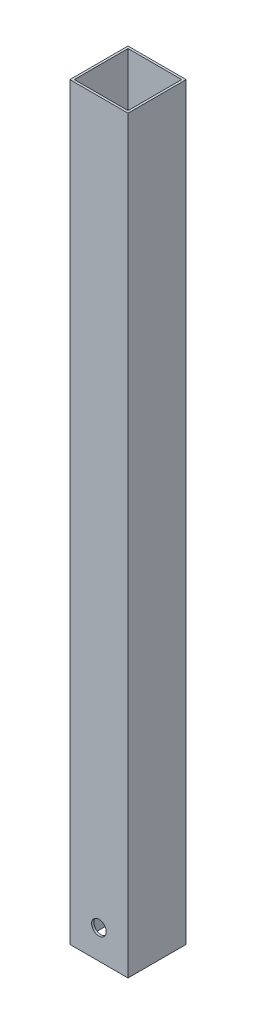
ISO-10303-21;
HEADER;
FILE_DESCRIPTION(('STEP AP214'),'2;1');
FILE_NAME('part.step','',(''),(''),'','','');
FILE_SCHEMA(('AUTOMOTIVE_DESIGN { 1 0 10303 214 1 1 1 1 }'));
ENDSEC;
DATA;
#1=APPLICATION_CONTEXT('core data for automotive mechanical design processes');
#2=APPLICATION_PROTOCOL_DEFINITION('international standard','automotive_design',2000,#1);
#3=PRODUCT_CONTEXT('',#1,'mechanical');
#4=PRODUCT('Part','Part','',(#3));
#5=PRODUCT_RELATED_PRODUCT_CATEGORY('part','',(#4));
#6=PRODUCT_DEFINITION_FORMATION('','',#4);
#7=PRODUCT_DEFINITION_CONTEXT('part definition',#1,'design');
#8=PRODUCT_DEFINITION('design','',#6,#7);
#9=PRODUCT_DEFINITION_SHAPE('','',#8);
#10=(LENGTH_UNIT() NAMED_UNIT(*) SI_UNIT(.MILLI.,.METRE.));
#11=(NAMED_UNIT(*) PLANE_ANGLE_UNIT() SI_UNIT($,.RADIAN.));
#12=(NAMED_UNIT(*) SI_UNIT($,.STERADIAN.) SOLID_ANGLE_UNIT());
#13=UNCERTAINTY_MEASURE_WITH_UNIT(LENGTH_MEASURE(1.E-05),#10,'distance_accuracy_value','');
#14=(GEOMETRIC_REPRESENTATION_CONTEXT(3) GLOBAL_UNCERTAINTY_ASSIGNED_CONTEXT((#13)) GLOBAL_UNIT_ASSIGNED_CONTEXT((#10,
#11,#12)) REPRESENTATION_CONTEXT('',''));
#15=CARTESIAN_POINT('',(0.,0.,0.));
#16=DIRECTION('',(0.,0.,1.));
#17=DIRECTION('',(1.,0.,0.));
#18=AXIS2_PLACEMENT_3D('',#15,#16,#17);
#19=CARTESIAN_POINT('',(0.,327.152,0.));
#20=DIRECTION('',(0.,1.,0.));
#21=DIRECTION('',(0.,0.,1.));
#22=AXIS2_PLACEMENT_3D('',#19,#20,#21);
#23=PLANE('',#22);
#24=DIRECTION('',(0.,0.,-1.));
#25=VECTOR('',#24,1.);
#26=CARTESIAN_POINT('',(12.7,327.152,-12.7));
#27=LINE('',#26,#25);
#28=CARTESIAN_POINT('',(12.7,327.152,12.7));
#29=VERTEX_POINT('',#28);
#30=CARTESIAN_POINT('',(12.7,327.152,-12.7));
#31=VERTEX_POINT('',#30);
#32=EDGE_CURVE('E139',#29,#31,#27,.T.);
#33=ORIENTED_EDGE('',*,*,#32,.T.);
#34=DIRECTION('',(-1.,0.,0.));
#35=VECTOR('',#34,1.);
#36=CARTESIAN_POINT('',(-12.7,327.152,-12.7));
#37=LINE('',#36,#35);
#38=CARTESIAN_POINT('',(-12.7,327.152,-12.7));
#39=VERTEX_POINT('',#38);
#40=EDGE_CURVE('E142',#31,#39,#37,.T.);
#41=ORIENTED_EDGE('',*,*,#40,.T.);
#42=DIRECTION('',(0.,0.,1.));
#43=VECTOR('',#42,1.);
#44=CARTESIAN_POINT('',(-12.7,327.152,-12.7));
#45=LINE('',#44,#43);
#46=CARTESIAN_POINT('',(-12.7,327.152,12.7));
#47=VERTEX_POINT('',#46);
#48=EDGE_CURVE('E145',#39,#47,#45,.T.);
#49=ORIENTED_EDGE('',*,*,#48,.T.);
#50=DIRECTION('',(1.,0.,0.));
#51=VECTOR('',#50,1.);
#52=CARTESIAN_POINT('',(-12.7,327.152,12.7));
#53=LINE('',#52,#51);
#54=EDGE_CURVE('E147',#47,#29,#53,.T.);
#55=ORIENTED_EDGE('',*,*,#54,.T.);
#56=EDGE_LOOP('',(#33,#41,#49,#55));
#57=FACE_BOUND('',#56,.T.);
#58=DIRECTION('',(1.,0.,0.));
#59=VECTOR('',#58,1.);
#60=CARTESIAN_POINT('',(-11.7348,327.152,11.7348));
#61=LINE('',#60,#59);
#62=CARTESIAN_POINT('',(-11.7348,327.152,11.7348));
#63=VERTEX_POINT('',#62);
#64=CARTESIAN_POINT('',(11.7348,327.152,11.7348));
#65=VERTEX_POINT('',#64);
#66=EDGE_CURVE('E109',#63,#65,#61,.T.);
#67=ORIENTED_EDGE('',*,*,#66,.F.);
#68=DIRECTION('',(0.,0.,1.));
#69=VECTOR('',#68,1.);
#70=CARTESIAN_POINT('',(-11.7348,327.152,-11.7348));
#71=LINE('',#70,#69);
#72=CARTESIAN_POINT('',(-11.7348,327.152,-11.7348));
#73=VERTEX_POINT('',#72);
#74=EDGE_CURVE('E101',#73,#63,#71,.T.);
#75=ORIENTED_EDGE('',*,*,#74,.F.);
#76=DIRECTION('',(-1.,0.,0.));
#77=VECTOR('',#76,1.);
#78=CARTESIAN_POINT('',(-11.7348,327.152,-11.7348));
#79=LINE('',#78,#77);
#80=CARTESIAN_POINT('',(11.7348,327.152,-11.7348));
#81=VERTEX_POINT('',#80);
#82=EDGE_CURVE('E123',#81,#73,#79,.T.);
#83=ORIENTED_EDGE('',*,*,#82,.F.);
#84=DIRECTION('',(0.,0.,-1.));
#85=VECTOR('',#84,1.);
#86=CARTESIAN_POINT('',(11.7348,327.152,-11.7348));
#87=LINE('',#86,#85);
#88=EDGE_CURVE('E121',#65,#81,#87,.T.);
#89=ORIENTED_EDGE('',*,*,#88,.F.);
#90=EDGE_LOOP('',(#67,#75,#83,#89));
#91=FACE_BOUND('',#90,.T.);
#92=ADVANCED_FACE('F35',(#57,#91),#23,.T.);
#93=CARTESIAN_POINT('',(0.,0.,0.));
#94=DIRECTION('',(0.,1.,0.));
#95=DIRECTION('',(0.,0.,1.));
#96=AXIS2_PLACEMENT_3D('',#93,#94,#95);
#97=PLANE('',#96);
#98=DIRECTION('',(0.,0.,-1.));
#99=VECTOR('',#98,1.);
#100=CARTESIAN_POINT('',(12.7,0.,-12.7));
#101=LINE('',#100,#99);
#102=CARTESIAN_POINT('',(12.7,0.,12.7));
#103=VERTEX_POINT('',#102);
#104=CARTESIAN_POINT('',(12.7,0.,-12.7));
#105=VERTEX_POINT('',#104);
#106=EDGE_CURVE('E117',#103,#105,#101,.T.);
#107=ORIENTED_EDGE('',*,*,#106,.F.);
#108=DIRECTION('',(1.,0.,0.));
#109=VECTOR('',#108,1.);
#110=CARTESIAN_POINT('',(-12.7,0.,12.7));
#111=LINE('',#110,#109);
#112=CARTESIAN_POINT('',(-12.7,0.,12.7));
#113=VERTEX_POINT('',#112);
#114=EDGE_CURVE('E143',#113,#103,#111,.T.);
#115=ORIENTED_EDGE('',*,*,#114,.F.);
#116=DIRECTION('',(0.,0.,1.));
#117=VECTOR('',#116,1.);
#118=CARTESIAN_POINT('',(-12.7,0.,-12.7));
#119=LINE('',#118,#117);
#120=CARTESIAN_POINT('',(-12.7,0.,-12.7));
#121=VERTEX_POINT('',#120);
#122=EDGE_CURVE('E154',#121,#113,#119,.T.);
#123=ORIENTED_EDGE('',*,*,#122,.F.);
#124=DIRECTION('',(-1.,0.,0.));
#125=VECTOR('',#124,1.);
#126=CARTESIAN_POINT('',(-12.7,0.,-12.7));
#127=LINE('',#126,#125);
#128=EDGE_CURVE('E152',#105,#121,#127,.T.);
#129=ORIENTED_EDGE('',*,*,#128,.F.);
#130=EDGE_LOOP('',(#107,#115,#123,#129));
#131=FACE_BOUND('',#130,.T.);
#132=DIRECTION('',(0.,0.,1.));
#133=VECTOR('',#132,1.);
#134=CARTESIAN_POINT('',(-11.7348,0.,-11.7348));
#135=LINE('',#134,#133);
#136=CARTESIAN_POINT('',(-11.7348,0.,-11.7348));
#137=VERTEX_POINT('',#136);
#138=CARTESIAN_POINT('',(-11.7348,0.,11.7348));
#139=VERTEX_POINT('',#138);
#140=EDGE_CURVE('E59',#137,#139,#135,.T.);
#141=ORIENTED_EDGE('',*,*,#140,.T.);
#142=DIRECTION('',(1.,0.,0.));
#143=VECTOR('',#142,1.);
#144=CARTESIAN_POINT('',(-11.7348,0.,11.7348));
#145=LINE('',#144,#143);
#146=CARTESIAN_POINT('',(11.7348,0.,11.7348));
#147=VERTEX_POINT('',#146);
#148=EDGE_CURVE('E116',#139,#147,#145,.T.);
#149=ORIENTED_EDGE('',*,*,#148,.T.);
#150=DIRECTION('',(0.,0.,-1.));
#151=VECTOR('',#150,1.);
#152=CARTESIAN_POINT('',(11.7348,0.,-11.7348));
#153=LINE('',#152,#151);
#154=CARTESIAN_POINT('',(11.7348,0.,-11.7348));
#155=VERTEX_POINT('',#154);
#156=EDGE_CURVE('E131',#147,#155,#153,.T.);
#157=ORIENTED_EDGE('',*,*,#156,.T.);
#158=DIRECTION('',(-1.,0.,0.));
#159=VECTOR('',#158,1.);
#160=CARTESIAN_POINT('',(-11.7348,0.,-11.7348));
#161=LINE('',#160,#159);
#162=EDGE_CURVE('E110',#155,#137,#161,.T.);
#163=ORIENTED_EDGE('',*,*,#162,.T.);
#164=EDGE_LOOP('',(#141,#149,#157,#163));
#165=FACE_BOUND('',#164,.T.);
#166=ADVANCED_FACE('F173',(#131,#165),#97,.F.);
#167=CARTESIAN_POINT('',(12.7,327.152,-12.7));
#168=DIRECTION('',(-1.,0.,0.));
#169=DIRECTION('',(0.,0.,1.));
#170=AXIS2_PLACEMENT_3D('',#167,#168,#169);
#171=PLANE('',#170);
#172=ORIENTED_EDGE('',*,*,#106,.T.);
#173=DIRECTION('',(0.,-1.,0.));
#174=VECTOR('',#173,1.);
#175=CARTESIAN_POINT('',(12.7,327.152,-12.7));
#176=LINE('',#175,#174);
#177=EDGE_CURVE('E11',#31,#105,#176,.T.);
#178=ORIENTED_EDGE('',*,*,#177,.F.);
#179=ORIENTED_EDGE('',*,*,#32,.F.);
#180=DIRECTION('',(0.,-1.,0.));
#181=VECTOR('',#180,1.);
#182=CARTESIAN_POINT('',(12.7,327.152,12.7));
#183=LINE('',#182,#181);
#184=EDGE_CURVE('E149',#29,#103,#183,.T.);
#185=ORIENTED_EDGE('',*,*,#184,.T.);
#186=EDGE_LOOP('',(#172,#178,#179,#185));
#187=FACE_BOUND('',#186,.T.);
#188=ADVANCED_FACE('F37',(#187),#171,.F.);
#189=CARTESIAN_POINT('',(-12.7,327.152,-12.7));
#190=DIRECTION('',(0.,0.,1.));
#191=DIRECTION('',(1.,0.,0.));
#192=AXIS2_PLACEMENT_3D('',#189,#190,#191);
#193=PLANE('',#192);
#194=CARTESIAN_POINT('',(0.,12.7,-12.7));
#195=DIRECTION('',(0.,0.,1.));
#196=DIRECTION('',(1.,0.,0.));
#197=AXIS2_PLACEMENT_3D('',#194,#195,#196);
#198=CIRCLE('',#197,3.175);
#199=CARTESIAN_POINT('',(3.175,12.7,-12.7));
#200=VERTEX_POINT('',#199);
#201=EDGE_CURVE('E129',#200,#200,#198,.T.);
#202=ORIENTED_EDGE('',*,*,#201,.T.);
#203=EDGE_LOOP('',(#202));
#204=FACE_BOUND('',#203,.T.);
#205=ORIENTED_EDGE('',*,*,#128,.T.);
#206=DIRECTION('',(0.,-1.,0.));
#207=VECTOR('',#206,1.);
#208=CARTESIAN_POINT('',(-12.7,327.152,-12.7));
#209=LINE('',#208,#207);
#210=EDGE_CURVE('E44',#39,#121,#209,.T.);
#211=ORIENTED_EDGE('',*,*,#210,.F.);
#212=ORIENTED_EDGE('',*,*,#40,.F.);
#213=ORIENTED_EDGE('',*,*,#177,.T.);
#214=EDGE_LOOP('',(#205,#211,#212,#213));
#215=FACE_BOUND('',#214,.T.);
#216=ADVANCED_FACE('F183',(#204,#215),#193,.F.);
#217=CARTESIAN_POINT('',(-12.7,327.152,-12.7));
#218=DIRECTION('',(1.,0.,0.));
#219=DIRECTION('',(0.,0.,-1.));
#220=AXIS2_PLACEMENT_3D('',#217,#218,#219);
#221=PLANE('',#220);
#222=ORIENTED_EDGE('',*,*,#122,.T.);
#223=DIRECTION('',(0.,-1.,0.));
#224=VECTOR('',#223,1.);
#225=CARTESIAN_POINT('',(-12.7,327.152,12.7));
#226=LINE('',#225,#224);
#227=EDGE_CURVE('E159',#47,#113,#226,.T.);
#228=ORIENTED_EDGE('',*,*,#227,.F.);
#229=ORIENTED_EDGE('',*,*,#48,.F.);
#230=ORIENTED_EDGE('',*,*,#210,.T.);
#231=EDGE_LOOP('',(#222,#228,#229,#230));
#232=FACE_BOUND('',#231,.T.);
#233=ADVANCED_FACE('F167',(#232),#221,.F.);
#234=CARTESIAN_POINT('',(-12.7,327.152,12.7));
#235=DIRECTION('',(0.,0.,-1.));
#236=DIRECTION('',(-1.,0.,0.));
#237=AXIS2_PLACEMENT_3D('',#234,#235,#236);
#238=PLANE('',#237);
#239=CARTESIAN_POINT('',(0.,12.7,12.7));
#240=DIRECTION('',(0.,0.,1.));
#241=DIRECTION('',(1.,0.,0.));
#242=AXIS2_PLACEMENT_3D('',#239,#240,#241);
#243=CIRCLE('',#242,3.175);
#244=CARTESIAN_POINT('',(3.175,12.7,12.7));
#245=VERTEX_POINT('',#244);
#246=EDGE_CURVE('E208',#245,#245,#243,.T.);
#247=ORIENTED_EDGE('',*,*,#246,.F.);
#248=EDGE_LOOP('',(#247));
#249=FACE_BOUND('',#248,.T.);
#250=ORIENTED_EDGE('',*,*,#114,.T.);
#251=ORIENTED_EDGE('',*,*,#184,.F.);
#252=ORIENTED_EDGE('',*,*,#54,.F.);
#253=ORIENTED_EDGE('',*,*,#227,.T.);
#254=EDGE_LOOP('',(#250,#251,#252,#253));
#255=FACE_BOUND('',#254,.T.);
#256=ADVANCED_FACE('F177',(#249,#255),#238,.F.);
#257=CARTESIAN_POINT('',(-11.7348,327.152,-11.7348));
#258=DIRECTION('',(1.,0.,0.));
#259=DIRECTION('',(0.,0.,-1.));
#260=AXIS2_PLACEMENT_3D('',#257,#258,#259);
#261=PLANE('',#260);
#262=ORIENTED_EDGE('',*,*,#140,.F.);
#263=DIRECTION('',(0.,-1.,0.));
#264=VECTOR('',#263,1.);
#265=CARTESIAN_POINT('',(-11.7348,327.152,-11.7348));
#266=LINE('',#265,#264);
#267=EDGE_CURVE('E105',#73,#137,#266,.T.);
#268=ORIENTED_EDGE('',*,*,#267,.F.);
#269=ORIENTED_EDGE('',*,*,#74,.T.);
#270=DIRECTION('',(0.,-1.,0.));
#271=VECTOR('',#270,1.);
#272=CARTESIAN_POINT('',(-11.7348,327.152,11.7348));
#273=LINE('',#272,#271);
#274=EDGE_CURVE('E104',#63,#139,#273,.T.);
#275=ORIENTED_EDGE('',*,*,#274,.T.);
#276=EDGE_LOOP('',(#262,#268,#269,#275));
#277=FACE_BOUND('',#276,.T.);
#278=ADVANCED_FACE('F103',(#277),#261,.T.);
#279=CARTESIAN_POINT('',(-11.7348,327.152,11.7348));
#280=DIRECTION('',(0.,0.,-1.));
#281=DIRECTION('',(-1.,0.,0.));
#282=AXIS2_PLACEMENT_3D('',#279,#280,#281);
#283=PLANE('',#282);
#284=CARTESIAN_POINT('',(0.,12.7,11.7348));
#285=DIRECTION('',(0.,0.,-1.));
#286=DIRECTION('',(-1.,0.,0.));
#287=AXIS2_PLACEMENT_3D('',#284,#285,#286);
#288=CIRCLE('',#287,3.175);
#289=CARTESIAN_POINT('',(-3.175,12.7,11.7348));
#290=VERTEX_POINT('',#289);
#291=EDGE_CURVE('E212',#290,#290,#288,.T.);
#292=ORIENTED_EDGE('',*,*,#291,.F.);
#293=EDGE_LOOP('',(#292));
#294=FACE_BOUND('',#293,.T.);
#295=ORIENTED_EDGE('',*,*,#148,.F.);
#296=ORIENTED_EDGE('',*,*,#274,.F.);
#297=ORIENTED_EDGE('',*,*,#66,.T.);
#298=DIRECTION('',(0.,-1.,0.));
#299=VECTOR('',#298,1.);
#300=CARTESIAN_POINT('',(11.7348,327.152,11.7348));
#301=LINE('',#300,#299);
#302=EDGE_CURVE('E118',#65,#147,#301,.T.);
#303=ORIENTED_EDGE('',*,*,#302,.T.);
#304=EDGE_LOOP('',(#295,#296,#297,#303));
#305=FACE_BOUND('',#304,.T.);
#306=ADVANCED_FACE('F113',(#294,#305),#283,.T.);
#307=CARTESIAN_POINT('',(11.7348,327.152,-11.7348));
#308=DIRECTION('',(-1.,0.,0.));
#309=DIRECTION('',(0.,0.,1.));
#310=AXIS2_PLACEMENT_3D('',#307,#308,#309);
#311=PLANE('',#310);
#312=ORIENTED_EDGE('',*,*,#156,.F.);
#313=ORIENTED_EDGE('',*,*,#302,.F.);
#314=ORIENTED_EDGE('',*,*,#88,.T.);
#315=DIRECTION('',(0.,-1.,0.));
#316=VECTOR('',#315,1.);
#317=CARTESIAN_POINT('',(11.7348,327.152,-11.7348));
#318=LINE('',#317,#316);
#319=EDGE_CURVE('E51',#81,#155,#318,.T.);
#320=ORIENTED_EDGE('',*,*,#319,.T.);
#321=EDGE_LOOP('',(#312,#313,#314,#320));
#322=FACE_BOUND('',#321,.T.);
#323=ADVANCED_FACE('F228',(#322),#311,.T.);
#324=CARTESIAN_POINT('',(-11.7348,327.152,-11.7348));
#325=DIRECTION('',(0.,0.,1.));
#326=DIRECTION('',(1.,0.,0.));
#327=AXIS2_PLACEMENT_3D('',#324,#325,#326);
#328=PLANE('',#327);
#329=CARTESIAN_POINT('',(0.,12.7,-11.7348));
#330=DIRECTION('',(0.,0.,1.));
#331=DIRECTION('',(1.,0.,0.));
#332=AXIS2_PLACEMENT_3D('',#329,#330,#331);
#333=CIRCLE('',#332,3.175);
#334=CARTESIAN_POINT('',(3.175,12.7,-11.7348));
#335=VERTEX_POINT('',#334);
#336=EDGE_CURVE('E39',#335,#335,#333,.T.);
#337=ORIENTED_EDGE('',*,*,#336,.F.);
#338=EDGE_LOOP('',(#337));
#339=FACE_BOUND('',#338,.T.);
#340=ORIENTED_EDGE('',*,*,#162,.F.);
#341=ORIENTED_EDGE('',*,*,#319,.F.);
#342=ORIENTED_EDGE('',*,*,#82,.T.);
#343=ORIENTED_EDGE('',*,*,#267,.T.);
#344=EDGE_LOOP('',(#340,#341,#342,#343));
#345=FACE_BOUND('',#344,.T.);
#346=ADVANCED_FACE('F220',(#339,#345),#328,.T.);
#347=CARTESIAN_POINT('',(0.,12.7,-279.4));
#348=DIRECTION('',(0.,0.,1.));
#349=DIRECTION('',(1.,0.,0.));
#350=AXIS2_PLACEMENT_3D('',#347,#348,#349);
#351=CYLINDRICAL_SURFACE('',#350,3.175);
#352=ORIENTED_EDGE('',*,*,#336,.T.);
#353=EDGE_LOOP('',(#352));
#354=FACE_BOUND('',#353,.T.);
#355=ORIENTED_EDGE('',*,*,#201,.F.);
#356=EDGE_LOOP('',(#355));
#357=FACE_BOUND('',#356,.T.);
#358=ADVANCED_FACE('F217',(#354,#357),#351,.F.);
#359=ORIENTED_EDGE('',*,*,#291,.T.);
#360=EDGE_LOOP('',(#359));
#361=FACE_BOUND('',#360,.T.);
#362=ORIENTED_EDGE('',*,*,#246,.T.);
#363=EDGE_LOOP('',(#362));
#364=FACE_BOUND('',#363,.T.);
#365=ADVANCED_FACE('F219',(#361,#364),#351,.F.);
#366=CLOSED_SHELL('',(#92,#166,#188,#216,#233,#256,#278,#306,#323,#346,#358,#365));
#367=MANIFOLD_SOLID_BREP('B2',#366);
#368=ADVANCED_BREP_SHAPE_REPRESENTATION('',(#18,#367),#14);
#369=SHAPE_DEFINITION_REPRESENTATION(#9,#368);
ENDSEC;
END-ISO-10303-21;
